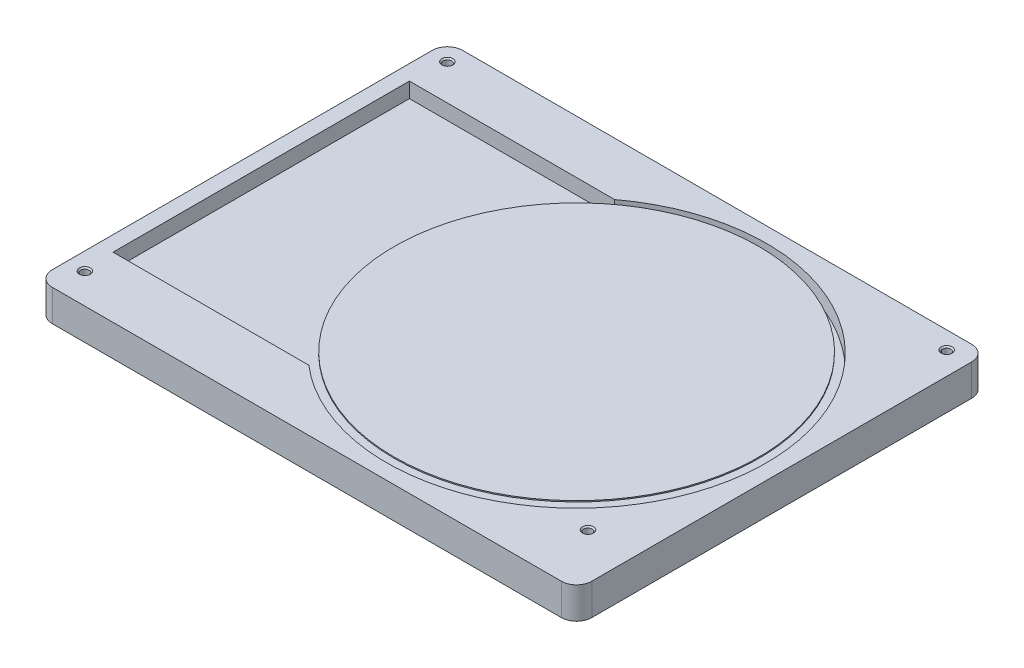
ISO-10303-21;
HEADER;
FILE_DESCRIPTION(('STEP AP214'),'2;1');
FILE_NAME('part.step','',(''),(''),'','','');
FILE_SCHEMA(('AUTOMOTIVE_DESIGN { 1 0 10303 214 1 1 1 1 }'));
ENDSEC;
DATA;
#1=APPLICATION_CONTEXT('core data for automotive mechanical design processes');
#2=APPLICATION_PROTOCOL_DEFINITION('international standard','automotive_design',2000,#1);
#3=PRODUCT_CONTEXT('',#1,'mechanical');
#4=PRODUCT('Part','Part','',(#3));
#5=PRODUCT_RELATED_PRODUCT_CATEGORY('part','',(#4));
#6=PRODUCT_DEFINITION_FORMATION('','',#4);
#7=PRODUCT_DEFINITION_CONTEXT('part definition',#1,'design');
#8=PRODUCT_DEFINITION('design','',#6,#7);
#9=PRODUCT_DEFINITION_SHAPE('','',#8);
#10=(LENGTH_UNIT() NAMED_UNIT(*) SI_UNIT(.MILLI.,.METRE.));
#11=(NAMED_UNIT(*) PLANE_ANGLE_UNIT() SI_UNIT($,.RADIAN.));
#12=(NAMED_UNIT(*) SI_UNIT($,.STERADIAN.) SOLID_ANGLE_UNIT());
#13=UNCERTAINTY_MEASURE_WITH_UNIT(LENGTH_MEASURE(1.E-05),#10,'distance_accuracy_value','');
#14=(GEOMETRIC_REPRESENTATION_CONTEXT(3) GLOBAL_UNCERTAINTY_ASSIGNED_CONTEXT((#13)) GLOBAL_UNIT_ASSIGNED_CONTEXT((#10,
#11,#12)) REPRESENTATION_CONTEXT('',''));
#15=CARTESIAN_POINT('',(0.,0.,0.));
#16=DIRECTION('',(0.,0.,1.));
#17=DIRECTION('',(1.,0.,0.));
#18=AXIS2_PLACEMENT_3D('',#15,#16,#17);
#19=CARTESIAN_POINT('',(35.5,4.15,27.));
#20=DIRECTION('',(-1.,0.,0.));
#21=DIRECTION('',(0.,0.,1.));
#22=AXIS2_PLACEMENT_3D('',#19,#20,#21);
#23=PLANE('',#22);
#24=DIRECTION('',(0.,0.,-1.));
#25=VECTOR('',#24,1.);
#26=CARTESIAN_POINT('',(35.5,0.,27.));
#27=LINE('',#26,#25);
#28=CARTESIAN_POINT('',(35.5,0.,25.));
#29=VERTEX_POINT('',#28);
#30=CARTESIAN_POINT('',(35.5,0.,-25.));
#31=VERTEX_POINT('',#30);
#32=EDGE_CURVE('E187',#29,#31,#27,.T.);
#33=ORIENTED_EDGE('',*,*,#32,.T.);
#34=DIRECTION('',(0.,-1.,0.));
#35=VECTOR('',#34,1.);
#36=CARTESIAN_POINT('',(35.5,4.15,-25.));
#37=LINE('',#36,#35);
#38=CARTESIAN_POINT('',(35.5,4.15,-25.));
#39=VERTEX_POINT('',#38);
#40=EDGE_CURVE('E11',#31,#39,#37,.F.);
#41=ORIENTED_EDGE('',*,*,#40,.T.);
#42=DIRECTION('',(0.,0.,-1.));
#43=VECTOR('',#42,1.);
#44=CARTESIAN_POINT('',(35.5,4.15,27.));
#45=LINE('',#44,#43);
#46=CARTESIAN_POINT('',(35.5,4.15,25.));
#47=VERTEX_POINT('',#46);
#48=EDGE_CURVE('E193',#47,#39,#45,.T.);
#49=ORIENTED_EDGE('',*,*,#48,.F.);
#50=DIRECTION('',(0.,-1.,0.));
#51=VECTOR('',#50,1.);
#52=CARTESIAN_POINT('',(35.5,4.15,25.));
#53=LINE('',#52,#51);
#54=EDGE_CURVE('E52',#47,#29,#53,.T.);
#55=ORIENTED_EDGE('',*,*,#54,.T.);
#56=EDGE_LOOP('',(#33,#41,#49,#55));
#57=FACE_BOUND('',#56,.T.);
#58=ADVANCED_FACE('F43',(#57),#23,.F.);
#59=CARTESIAN_POINT('',(-35.5,4.15,-27.));
#60=DIRECTION('',(0.,0.,1.));
#61=DIRECTION('',(1.,0.,0.));
#62=AXIS2_PLACEMENT_3D('',#59,#60,#61);
#63=PLANE('',#62);
#64=DIRECTION('',(-1.,0.,0.));
#65=VECTOR('',#64,1.);
#66=CARTESIAN_POINT('',(-35.5,0.,-27.));
#67=LINE('',#66,#65);
#68=CARTESIAN_POINT('',(33.5,0.,-27.));
#69=VERTEX_POINT('',#68);
#70=CARTESIAN_POINT('',(-33.5,0.,-27.));
#71=VERTEX_POINT('',#70);
#72=EDGE_CURVE('E212',#69,#71,#67,.T.);
#73=ORIENTED_EDGE('',*,*,#72,.T.);
#74=DIRECTION('',(0.,-1.,0.));
#75=VECTOR('',#74,1.);
#76=CARTESIAN_POINT('',(-33.5,4.15,-27.));
#77=LINE('',#76,#75);
#78=CARTESIAN_POINT('',(-33.5,4.15,-27.));
#79=VERTEX_POINT('',#78);
#80=EDGE_CURVE('E59',#71,#79,#77,.F.);
#81=ORIENTED_EDGE('',*,*,#80,.T.);
#82=DIRECTION('',(-1.,0.,0.));
#83=VECTOR('',#82,1.);
#84=CARTESIAN_POINT('',(-35.5,4.15,-27.));
#85=LINE('',#84,#83);
#86=CARTESIAN_POINT('',(33.5,4.15,-27.));
#87=VERTEX_POINT('',#86);
#88=EDGE_CURVE('E196',#87,#79,#85,.T.);
#89=ORIENTED_EDGE('',*,*,#88,.F.);
#90=DIRECTION('',(0.,-1.,0.));
#91=VECTOR('',#90,1.);
#92=CARTESIAN_POINT('',(33.5,4.15,-27.));
#93=LINE('',#92,#91);
#94=EDGE_CURVE('E258',#87,#69,#93,.T.);
#95=ORIENTED_EDGE('',*,*,#94,.T.);
#96=EDGE_LOOP('',(#73,#81,#89,#95));
#97=FACE_BOUND('',#96,.T.);
#98=ADVANCED_FACE('F279',(#97),#63,.F.);
#99=CARTESIAN_POINT('',(-35.5,4.15,27.));
#100=DIRECTION('',(1.,0.,0.));
#101=DIRECTION('',(0.,0.,-1.));
#102=AXIS2_PLACEMENT_3D('',#99,#100,#101);
#103=PLANE('',#102);
#104=DIRECTION('',(0.,0.,1.));
#105=VECTOR('',#104,1.);
#106=CARTESIAN_POINT('',(-35.5,0.,27.));
#107=LINE('',#106,#105);
#108=CARTESIAN_POINT('',(-35.5,0.,-25.));
#109=VERTEX_POINT('',#108);
#110=CARTESIAN_POINT('',(-35.5,0.,25.));
#111=VERTEX_POINT('',#110);
#112=EDGE_CURVE('E215',#109,#111,#107,.T.);
#113=ORIENTED_EDGE('',*,*,#112,.T.);
#114=DIRECTION('',(0.,-1.,0.));
#115=VECTOR('',#114,1.);
#116=CARTESIAN_POINT('',(-35.5,4.15,25.));
#117=LINE('',#116,#115);
#118=CARTESIAN_POINT('',(-35.5,4.15,25.));
#119=VERTEX_POINT('',#118);
#120=EDGE_CURVE('E244',#111,#119,#117,.F.);
#121=ORIENTED_EDGE('',*,*,#120,.T.);
#122=DIRECTION('',(0.,0.,1.));
#123=VECTOR('',#122,1.);
#124=CARTESIAN_POINT('',(-35.5,4.15,27.));
#125=LINE('',#124,#123);
#126=CARTESIAN_POINT('',(-35.5,4.15,-25.));
#127=VERTEX_POINT('',#126);
#128=EDGE_CURVE('E200',#127,#119,#125,.T.);
#129=ORIENTED_EDGE('',*,*,#128,.F.);
#130=DIRECTION('',(0.,-1.,0.));
#131=VECTOR('',#130,1.);
#132=CARTESIAN_POINT('',(-35.5,4.15,-25.));
#133=LINE('',#132,#131);
#134=EDGE_CURVE('E240',#127,#109,#133,.T.);
#135=ORIENTED_EDGE('',*,*,#134,.T.);
#136=EDGE_LOOP('',(#113,#121,#129,#135));
#137=FACE_BOUND('',#136,.T.);
#138=ADVANCED_FACE('F288',(#137),#103,.F.);
#139=CARTESIAN_POINT('',(-35.5,4.15,27.));
#140=DIRECTION('',(0.,0.,-1.));
#141=DIRECTION('',(-1.,0.,0.));
#142=AXIS2_PLACEMENT_3D('',#139,#140,#141);
#143=PLANE('',#142);
#144=DIRECTION('',(1.,0.,0.));
#145=VECTOR('',#144,1.);
#146=CARTESIAN_POINT('',(-35.5,4.15,27.));
#147=LINE('',#146,#145);
#148=CARTESIAN_POINT('',(-33.5,4.15,27.));
#149=VERTEX_POINT('',#148);
#150=CARTESIAN_POINT('',(33.5,4.15,27.));
#151=VERTEX_POINT('',#150);
#152=EDGE_CURVE('E204',#149,#151,#147,.T.);
#153=ORIENTED_EDGE('',*,*,#152,.F.);
#154=DIRECTION('',(0.,-1.,0.));
#155=VECTOR('',#154,1.);
#156=CARTESIAN_POINT('',(-33.5,4.15,27.));
#157=LINE('',#156,#155);
#158=CARTESIAN_POINT('',(-33.5,0.,27.));
#159=VERTEX_POINT('',#158);
#160=EDGE_CURVE('E224',#149,#159,#157,.T.);
#161=ORIENTED_EDGE('',*,*,#160,.T.);
#162=DIRECTION('',(1.,0.,0.));
#163=VECTOR('',#162,1.);
#164=CARTESIAN_POINT('',(-35.5,0.,27.));
#165=LINE('',#164,#163);
#166=CARTESIAN_POINT('',(33.5,0.,27.));
#167=VERTEX_POINT('',#166);
#168=EDGE_CURVE('E197',#159,#167,#165,.T.);
#169=ORIENTED_EDGE('',*,*,#168,.T.);
#170=DIRECTION('',(0.,-1.,0.));
#171=VECTOR('',#170,1.);
#172=CARTESIAN_POINT('',(33.5,4.15,27.));
#173=LINE('',#172,#171);
#174=EDGE_CURVE('E208',#167,#151,#173,.F.);
#175=ORIENTED_EDGE('',*,*,#174,.T.);
#176=EDGE_LOOP('',(#153,#161,#169,#175));
#177=FACE_BOUND('',#176,.T.);
#178=ADVANCED_FACE('F296',(#177),#143,.F.);
#179=CARTESIAN_POINT('',(0.,4.15,0.));
#180=DIRECTION('',(0.,-1.,0.));
#181=DIRECTION('',(0.,0.,-1.));
#182=AXIS2_PLACEMENT_3D('',#179,#180,#181);
#183=PLANE('',#182);
#184=CARTESIAN_POINT('',(-33.2,4.15,-24.7));
#185=DIRECTION('',(0.,1.,0.));
#186=DIRECTION('',(0.,0.,1.));
#187=AXIS2_PLACEMENT_3D('',#184,#185,#186);
#188=CIRCLE('',#187,0.724999999999997);
#189=CARTESIAN_POINT('',(-33.2,4.15,-23.975));
#190=VERTEX_POINT('',#189);
#191=EDGE_CURVE('E578',#190,#190,#188,.T.);
#192=ORIENTED_EDGE('',*,*,#191,.F.);
#193=EDGE_LOOP('',(#192));
#194=FACE_BOUND('',#193,.T.);
#195=CARTESIAN_POINT('',(-33.2,4.15,23.));
#196=DIRECTION('',(0.,1.,0.));
#197=DIRECTION('',(0.,0.,1.));
#198=AXIS2_PLACEMENT_3D('',#195,#196,#197);
#199=CIRCLE('',#198,0.725000000000003);
#200=CARTESIAN_POINT('',(-33.2,4.15,23.725));
#201=VERTEX_POINT('',#200);
#202=EDGE_CURVE('E582',#201,#201,#199,.T.);
#203=ORIENTED_EDGE('',*,*,#202,.F.);
#204=EDGE_LOOP('',(#203));
#205=FACE_BOUND('',#204,.T.);
#206=CARTESIAN_POINT('',(29.4,4.15,19.4));
#207=DIRECTION('',(0.,1.,0.));
#208=DIRECTION('',(0.,0.,1.));
#209=AXIS2_PLACEMENT_3D('',#206,#207,#208);
#210=CIRCLE('',#209,0.725);
#211=CARTESIAN_POINT('',(29.4,4.15,20.125));
#212=VERTEX_POINT('',#211);
#213=EDGE_CURVE('E586',#212,#212,#210,.T.);
#214=ORIENTED_EDGE('',*,*,#213,.F.);
#215=EDGE_LOOP('',(#214));
#216=FACE_BOUND('',#215,.T.);
#217=CARTESIAN_POINT('',(32.5,4.15,-24.7));
#218=DIRECTION('',(0.,1.,0.));
#219=DIRECTION('',(0.,0.,1.));
#220=AXIS2_PLACEMENT_3D('',#217,#218,#219);
#221=CIRCLE('',#220,0.724999999999997);
#222=CARTESIAN_POINT('',(32.5,4.15,-23.975));
#223=VERTEX_POINT('',#222);
#224=EDGE_CURVE('E590',#223,#223,#221,.T.);
#225=ORIENTED_EDGE('',*,*,#224,.F.);
#226=EDGE_LOOP('',(#225));
#227=FACE_BOUND('',#226,.T.);
#228=DIRECTION('',(-1.,0.,0.));
#229=VECTOR('',#228,1.);
#230=CARTESIAN_POINT('',(-6.50000000000003,4.15,-20.));
#231=LINE('',#230,#229);
#232=CARTESIAN_POINT('',(-6.50000000000003,4.15,-20.));
#233=VERTEX_POINT('',#232);
#234=CARTESIAN_POINT('',(-33.5,4.15,-20.));
#235=VERTEX_POINT('',#234);
#236=EDGE_CURVE('E177',#233,#235,#231,.T.);
#237=ORIENTED_EDGE('',*,*,#236,.F.);
#238=CARTESIAN_POINT('',(8.49999999999999,4.15,0.));
#239=DIRECTION('',(0.,1.,0.));
#240=DIRECTION('',(0.,0.,1.));
#241=AXIS2_PLACEMENT_3D('',#238,#239,#240);
#242=CIRCLE('',#241,25.);
#243=CARTESIAN_POINT('',(-7.74807680927193,4.15,19.));
#244=VERTEX_POINT('',#243);
#245=EDGE_CURVE('E141',#244,#233,#242,.T.);
#246=ORIENTED_EDGE('',*,*,#245,.F.);
#247=DIRECTION('',(1.,0.,0.));
#248=VECTOR('',#247,1.);
#249=CARTESIAN_POINT('',(-7.74807680927193,4.15,19.));
#250=LINE('',#249,#248);
#251=CARTESIAN_POINT('',(-33.5,4.15,19.));
#252=VERTEX_POINT('',#251);
#253=EDGE_CURVE('E161',#252,#244,#250,.T.);
#254=ORIENTED_EDGE('',*,*,#253,.F.);
#255=DIRECTION('',(0.,0.,1.));
#256=VECTOR('',#255,1.);
#257=CARTESIAN_POINT('',(-33.5,4.15,-20.));
#258=LINE('',#257,#256);
#259=EDGE_CURVE('E165',#235,#252,#258,.T.);
#260=ORIENTED_EDGE('',*,*,#259,.F.);
#261=EDGE_LOOP('',(#237,#246,#254,#260));
#262=FACE_BOUND('',#261,.T.);
#263=ORIENTED_EDGE('',*,*,#128,.T.);
#264=CARTESIAN_POINT('',(-33.5,4.15,25.));
#265=DIRECTION('',(0.,-1.,0.));
#266=DIRECTION('',(0.,0.,-1.));
#267=AXIS2_PLACEMENT_3D('',#264,#265,#266);
#268=CIRCLE('',#267,2.);
#269=EDGE_CURVE('E255',#119,#149,#268,.F.);
#270=ORIENTED_EDGE('',*,*,#269,.T.);
#271=ORIENTED_EDGE('',*,*,#152,.T.);
#272=CARTESIAN_POINT('',(33.5,4.15,25.));
#273=DIRECTION('',(0.,-1.,0.));
#274=DIRECTION('',(0.,0.,-1.));
#275=AXIS2_PLACEMENT_3D('',#272,#273,#274);
#276=CIRCLE('',#275,2.);
#277=EDGE_CURVE('E247',#151,#47,#276,.F.);
#278=ORIENTED_EDGE('',*,*,#277,.T.);
#279=ORIENTED_EDGE('',*,*,#48,.T.);
#280=CARTESIAN_POINT('',(33.5,4.15,-25.));
#281=DIRECTION('',(0.,-1.,0.));
#282=DIRECTION('',(0.,0.,-1.));
#283=AXIS2_PLACEMENT_3D('',#280,#281,#282);
#284=CIRCLE('',#283,2.);
#285=EDGE_CURVE('E66',#39,#87,#284,.F.);
#286=ORIENTED_EDGE('',*,*,#285,.T.);
#287=ORIENTED_EDGE('',*,*,#88,.T.);
#288=CARTESIAN_POINT('',(-33.5,4.15,-25.));
#289=DIRECTION('',(0.,-1.,0.));
#290=DIRECTION('',(0.,0.,-1.));
#291=AXIS2_PLACEMENT_3D('',#288,#289,#290);
#292=CIRCLE('',#291,2.);
#293=EDGE_CURVE('E252',#79,#127,#292,.F.);
#294=ORIENTED_EDGE('',*,*,#293,.T.);
#295=EDGE_LOOP('',(#263,#270,#271,#278,#279,#286,#287,#294));
#296=FACE_BOUND('',#295,.T.);
#297=ADVANCED_FACE('F281',(#194,#205,#216,#227,#262,#296),#183,.F.);
#298=CARTESIAN_POINT('',(0.,0.,0.));
#299=DIRECTION('',(0.,-1.,0.));
#300=DIRECTION('',(0.,0.,-1.));
#301=AXIS2_PLACEMENT_3D('',#298,#299,#300);
#302=PLANE('',#301);
#303=CARTESIAN_POINT('',(-33.2,0.,-24.7));
#304=DIRECTION('',(0.,1.,0.));
#305=DIRECTION('',(0.,0.,1.));
#306=AXIS2_PLACEMENT_3D('',#303,#304,#305);
#307=CIRCLE('',#306,0.550000000000002);
#308=CARTESIAN_POINT('',(-33.2,0.,-24.15));
#309=VERTEX_POINT('',#308);
#310=EDGE_CURVE('E648',#309,#309,#307,.T.);
#311=ORIENTED_EDGE('',*,*,#310,.T.);
#312=EDGE_LOOP('',(#311));
#313=FACE_BOUND('',#312,.T.);
#314=CARTESIAN_POINT('',(-33.2,0.,23.));
#315=DIRECTION('',(0.,1.,0.));
#316=DIRECTION('',(0.,0.,1.));
#317=AXIS2_PLACEMENT_3D('',#314,#315,#316);
#318=CIRCLE('',#317,0.550000000000002);
#319=CARTESIAN_POINT('',(-33.2,0.,23.55));
#320=VERTEX_POINT('',#319);
#321=EDGE_CURVE('E638',#320,#320,#318,.T.);
#322=ORIENTED_EDGE('',*,*,#321,.T.);
#323=EDGE_LOOP('',(#322));
#324=FACE_BOUND('',#323,.T.);
#325=CARTESIAN_POINT('',(29.4,0.,19.4));
#326=DIRECTION('',(0.,1.,0.));
#327=DIRECTION('',(0.,0.,1.));
#328=AXIS2_PLACEMENT_3D('',#325,#326,#327);
#329=CIRCLE('',#328,0.549999999999998);
#330=CARTESIAN_POINT('',(29.4,0.,19.95));
#331=VERTEX_POINT('',#330);
#332=EDGE_CURVE('E596',#331,#331,#329,.T.);
#333=ORIENTED_EDGE('',*,*,#332,.T.);
#334=EDGE_LOOP('',(#333));
#335=FACE_BOUND('',#334,.T.);
#336=CARTESIAN_POINT('',(32.5,0.,-24.7));
#337=DIRECTION('',(0.,1.,0.));
#338=DIRECTION('',(0.,0.,1.));
#339=AXIS2_PLACEMENT_3D('',#336,#337,#338);
#340=CIRCLE('',#339,0.550000000000002);
#341=CARTESIAN_POINT('',(32.5,0.,-24.15));
#342=VERTEX_POINT('',#341);
#343=EDGE_CURVE('E601',#342,#342,#340,.T.);
#344=ORIENTED_EDGE('',*,*,#343,.T.);
#345=EDGE_LOOP('',(#344));
#346=FACE_BOUND('',#345,.T.);
#347=ORIENTED_EDGE('',*,*,#168,.F.);
#348=CARTESIAN_POINT('',(-33.5,0.,25.));
#349=DIRECTION('',(0.,-1.,0.));
#350=DIRECTION('',(0.,0.,-1.));
#351=AXIS2_PLACEMENT_3D('',#348,#349,#350);
#352=CIRCLE('',#351,2.);
#353=EDGE_CURVE('E237',#159,#111,#352,.T.);
#354=ORIENTED_EDGE('',*,*,#353,.T.);
#355=ORIENTED_EDGE('',*,*,#112,.F.);
#356=CARTESIAN_POINT('',(-33.5,0.,-25.));
#357=DIRECTION('',(0.,-1.,0.));
#358=DIRECTION('',(0.,0.,-1.));
#359=AXIS2_PLACEMENT_3D('',#356,#357,#358);
#360=CIRCLE('',#359,2.);
#361=EDGE_CURVE('E234',#109,#71,#360,.T.);
#362=ORIENTED_EDGE('',*,*,#361,.T.);
#363=ORIENTED_EDGE('',*,*,#72,.F.);
#364=CARTESIAN_POINT('',(33.5,0.,-25.));
#365=DIRECTION('',(0.,-1.,0.));
#366=DIRECTION('',(0.,0.,-1.));
#367=AXIS2_PLACEMENT_3D('',#364,#365,#366);
#368=CIRCLE('',#367,2.);
#369=EDGE_CURVE('E231',#69,#31,#368,.T.);
#370=ORIENTED_EDGE('',*,*,#369,.T.);
#371=ORIENTED_EDGE('',*,*,#32,.F.);
#372=CARTESIAN_POINT('',(33.5,0.,25.));
#373=DIRECTION('',(0.,-1.,0.));
#374=DIRECTION('',(0.,0.,-1.));
#375=AXIS2_PLACEMENT_3D('',#372,#373,#374);
#376=CIRCLE('',#375,2.);
#377=EDGE_CURVE('E228',#29,#167,#376,.T.);
#378=ORIENTED_EDGE('',*,*,#377,.T.);
#379=EDGE_LOOP('',(#347,#354,#355,#362,#363,#370,#371,#378));
#380=FACE_BOUND('',#379,.T.);
#381=ADVANCED_FACE('F274',(#313,#324,#335,#346,#380),#302,.T.);
#382=CARTESIAN_POINT('',(8.49999999999999,2.15,0.));
#383=DIRECTION('',(0.,1.,0.));
#384=DIRECTION('',(0.,0.,1.));
#385=AXIS2_PLACEMENT_3D('',#382,#383,#384);
#386=CYLINDRICAL_SURFACE('',#385,25.);
#387=ORIENTED_EDGE('',*,*,#245,.T.);
#388=DIRECTION('',(0.,1.,0.));
#389=VECTOR('',#388,1.);
#390=CARTESIAN_POINT('',(-6.50000000000003,2.15,-20.));
#391=LINE('',#390,#389);
#392=CARTESIAN_POINT('',(-6.50000000000003,2.15,-20.));
#393=VERTEX_POINT('',#392);
#394=EDGE_CURVE('E134',#393,#233,#391,.T.);
#395=ORIENTED_EDGE('',*,*,#394,.F.);
#396=CARTESIAN_POINT('',(8.49999999999999,2.15,0.));
#397=DIRECTION('',(0.,1.,0.));
#398=DIRECTION('',(0.,0.,1.));
#399=AXIS2_PLACEMENT_3D('',#396,#397,#398);
#400=CIRCLE('',#399,25.);
#401=CARTESIAN_POINT('',(-7.74807680927193,2.15,19.));
#402=VERTEX_POINT('',#401);
#403=EDGE_CURVE('E138',#402,#393,#400,.T.);
#404=ORIENTED_EDGE('',*,*,#403,.F.);
#405=DIRECTION('',(0.,1.,0.));
#406=VECTOR('',#405,1.);
#407=CARTESIAN_POINT('',(-7.74807680927193,2.15,19.));
#408=LINE('',#407,#406);
#409=EDGE_CURVE('E184',#402,#244,#408,.T.);
#410=ORIENTED_EDGE('',*,*,#409,.T.);
#411=EDGE_LOOP('',(#387,#395,#404,#410));
#412=FACE_BOUND('',#411,.T.);
#413=ADVANCED_FACE('F136',(#412),#386,.F.);
#414=CARTESIAN_POINT('',(-7.74807680927193,2.15,19.));
#415=DIRECTION('',(0.,0.,1.));
#416=DIRECTION('',(1.,0.,0.));
#417=AXIS2_PLACEMENT_3D('',#414,#415,#416);
#418=PLANE('',#417);
#419=ORIENTED_EDGE('',*,*,#253,.T.);
#420=ORIENTED_EDGE('',*,*,#409,.F.);
#421=DIRECTION('',(1.,0.,0.));
#422=VECTOR('',#421,1.);
#423=CARTESIAN_POINT('',(-7.74807680927193,2.15,19.));
#424=LINE('',#423,#422);
#425=CARTESIAN_POINT('',(-33.5,2.15,19.));
#426=VERTEX_POINT('',#425);
#427=EDGE_CURVE('E147',#426,#402,#424,.T.);
#428=ORIENTED_EDGE('',*,*,#427,.F.);
#429=DIRECTION('',(0.,1.,0.));
#430=VECTOR('',#429,1.);
#431=CARTESIAN_POINT('',(-33.5,2.15,19.));
#432=LINE('',#431,#430);
#433=EDGE_CURVE('E188',#426,#252,#432,.T.);
#434=ORIENTED_EDGE('',*,*,#433,.T.);
#435=EDGE_LOOP('',(#419,#420,#428,#434));
#436=FACE_BOUND('',#435,.T.);
#437=ADVANCED_FACE('F474',(#436),#418,.F.);
#438=CARTESIAN_POINT('',(-33.5,2.15,-20.));
#439=DIRECTION('',(-1.,0.,0.));
#440=DIRECTION('',(0.,0.,1.));
#441=AXIS2_PLACEMENT_3D('',#438,#439,#440);
#442=PLANE('',#441);
#443=ORIENTED_EDGE('',*,*,#259,.T.);
#444=ORIENTED_EDGE('',*,*,#433,.F.);
#445=DIRECTION('',(0.,0.,1.));
#446=VECTOR('',#445,1.);
#447=CARTESIAN_POINT('',(-33.5,2.15,-20.));
#448=LINE('',#447,#446);
#449=CARTESIAN_POINT('',(-33.5,2.15,-20.));
#450=VERTEX_POINT('',#449);
#451=EDGE_CURVE('E156',#450,#426,#448,.T.);
#452=ORIENTED_EDGE('',*,*,#451,.F.);
#453=DIRECTION('',(0.,1.,0.));
#454=VECTOR('',#453,1.);
#455=CARTESIAN_POINT('',(-33.5,2.15,-20.));
#456=LINE('',#455,#454);
#457=EDGE_CURVE('E146',#450,#235,#456,.T.);
#458=ORIENTED_EDGE('',*,*,#457,.T.);
#459=EDGE_LOOP('',(#443,#444,#452,#458));
#460=FACE_BOUND('',#459,.T.);
#461=ADVANCED_FACE('F466',(#460),#442,.F.);
#462=CARTESIAN_POINT('',(-6.50000000000003,2.15,-20.));
#463=DIRECTION('',(0.,0.,-1.));
#464=DIRECTION('',(-1.,0.,0.));
#465=AXIS2_PLACEMENT_3D('',#462,#463,#464);
#466=PLANE('',#465);
#467=ORIENTED_EDGE('',*,*,#236,.T.);
#468=ORIENTED_EDGE('',*,*,#457,.F.);
#469=DIRECTION('',(-1.,0.,0.));
#470=VECTOR('',#469,1.);
#471=CARTESIAN_POINT('',(-6.50000000000003,2.15,-20.));
#472=LINE('',#471,#470);
#473=EDGE_CURVE('E150',#393,#450,#472,.T.);
#474=ORIENTED_EDGE('',*,*,#473,.F.);
#475=ORIENTED_EDGE('',*,*,#394,.T.);
#476=EDGE_LOOP('',(#467,#468,#474,#475));
#477=FACE_BOUND('',#476,.T.);
#478=ADVANCED_FACE('F151',(#477),#466,.F.);
#479=CARTESIAN_POINT('',(8.49999999999999,2.15,0.));
#480=DIRECTION('',(0.,1.,0.));
#481=DIRECTION('',(0.,0.,1.));
#482=AXIS2_PLACEMENT_3D('',#479,#480,#481);
#483=PLANE('',#482);
#484=CARTESIAN_POINT('',(8.49999999999999,2.15,0.));
#485=DIRECTION('',(0.,1.,0.));
#486=DIRECTION('',(0.,0.,1.));
#487=AXIS2_PLACEMENT_3D('',#484,#485,#486);
#488=CIRCLE('',#487,7.5);
#489=CARTESIAN_POINT('',(8.49999999999999,2.15,7.5));
#490=VERTEX_POINT('',#489);
#491=EDGE_CURVE('E168',#490,#490,#488,.T.);
#492=ORIENTED_EDGE('',*,*,#491,.F.);
#493=EDGE_LOOP('',(#492));
#494=FACE_BOUND('',#493,.T.);
#495=ORIENTED_EDGE('',*,*,#403,.T.);
#496=ORIENTED_EDGE('',*,*,#473,.T.);
#497=ORIENTED_EDGE('',*,*,#451,.T.);
#498=ORIENTED_EDGE('',*,*,#427,.T.);
#499=EDGE_LOOP('',(#495,#496,#497,#498));
#500=FACE_BOUND('',#499,.T.);
#501=ADVANCED_FACE('F158',(#494,#500),#483,.T.);
#502=CARTESIAN_POINT('',(8.49999999999999,4.15,0.));
#503=DIRECTION('',(0.,-1.,0.));
#504=DIRECTION('',(0.,0.,-1.));
#505=AXIS2_PLACEMENT_3D('',#502,#503,#504);
#506=CYLINDRICAL_SURFACE('',#505,7.5);
#507=CARTESIAN_POINT('',(8.49999999999999,4.15,0.));
#508=DIRECTION('',(0.,1.,0.));
#509=DIRECTION('',(0.,0.,1.));
#510=AXIS2_PLACEMENT_3D('',#507,#508,#509);
#511=CIRCLE('',#510,7.5);
#512=CARTESIAN_POINT('',(8.49999999999999,4.15,7.5));
#513=VERTEX_POINT('',#512);
#514=EDGE_CURVE('E178',#513,#513,#511,.T.);
#515=ORIENTED_EDGE('',*,*,#514,.F.);
#516=EDGE_LOOP('',(#515));
#517=FACE_BOUND('',#516,.T.);
#518=ORIENTED_EDGE('',*,*,#491,.T.);
#519=EDGE_LOOP('',(#518));
#520=FACE_BOUND('',#519,.T.);
#521=ADVANCED_FACE('F441',(#517,#520),#506,.T.);
#522=CARTESIAN_POINT('',(8.49999999999999,4.3,0.));
#523=DIRECTION('',(0.,-1.,0.));
#524=DIRECTION('',(0.,0.,-1.));
#525=AXIS2_PLACEMENT_3D('',#522,#523,#524);
#526=CYLINDRICAL_SURFACE('',#525,24.);
#527=CARTESIAN_POINT('',(8.49999999999999,4.3,0.));
#528=DIRECTION('',(0.,1.,0.));
#529=DIRECTION('',(0.,0.,1.));
#530=AXIS2_PLACEMENT_3D('',#527,#528,#529);
#531=CIRCLE('',#530,24.);
#532=CARTESIAN_POINT('',(8.49999999999999,4.3,24.));
#533=VERTEX_POINT('',#532);
#534=EDGE_CURVE('E612',#533,#533,#531,.T.);
#535=ORIENTED_EDGE('',*,*,#534,.F.);
#536=EDGE_LOOP('',(#535));
#537=FACE_BOUND('',#536,.T.);
#538=CARTESIAN_POINT('',(8.49999999999999,4.15,0.));
#539=DIRECTION('',(0.,1.,0.));
#540=DIRECTION('',(0.,0.,1.));
#541=AXIS2_PLACEMENT_3D('',#538,#539,#540);
#542=CIRCLE('',#541,24.);
#543=CARTESIAN_POINT('',(8.49999999999999,4.15,24.));
#544=VERTEX_POINT('',#543);
#545=EDGE_CURVE('E611',#544,#544,#542,.T.);
#546=ORIENTED_EDGE('',*,*,#545,.T.);
#547=EDGE_LOOP('',(#546));
#548=FACE_BOUND('',#547,.T.);
#549=ADVANCED_FACE('F432',(#537,#548),#526,.T.);
#550=CARTESIAN_POINT('',(8.49999999999999,4.3,0.));
#551=DIRECTION('',(0.,1.,0.));
#552=DIRECTION('',(0.,0.,1.));
#553=AXIS2_PLACEMENT_3D('',#550,#551,#552);
#554=PLANE('',#553);
#555=ORIENTED_EDGE('',*,*,#534,.T.);
#556=EDGE_LOOP('',(#555));
#557=FACE_BOUND('',#556,.T.);
#558=ADVANCED_FACE('F423',(#557),#554,.T.);
#559=CARTESIAN_POINT('',(8.49999999999999,4.15,0.));
#560=DIRECTION('',(0.,1.,0.));
#561=DIRECTION('',(0.,0.,1.));
#562=AXIS2_PLACEMENT_3D('',#559,#560,#561);
#563=PLANE('',#562);
#564=ORIENTED_EDGE('',*,*,#514,.T.);
#565=EDGE_LOOP('',(#564));
#566=FACE_BOUND('',#565,.T.);
#567=ORIENTED_EDGE('',*,*,#545,.F.);
#568=EDGE_LOOP('',(#567));
#569=FACE_BOUND('',#568,.T.);
#570=ADVANCED_FACE('F413',(#566,#569),#563,.F.);
#571=CARTESIAN_POINT('',(32.5,4.15,-24.7));
#572=DIRECTION('',(0.,1.,0.));
#573=DIRECTION('',(0.,0.,1.));
#574=AXIS2_PLACEMENT_3D('',#571,#572,#573);
#575=CYLINDRICAL_SURFACE('',#574,0.550000000000002);
#576=ORIENTED_EDGE('',*,*,#343,.F.);
#577=EDGE_LOOP('',(#576));
#578=FACE_BOUND('',#577,.T.);
#579=CARTESIAN_POINT('',(32.5,3.975,-24.7));
#580=DIRECTION('',(0.,1.,0.));
#581=DIRECTION('',(0.,0.,1.));
#582=AXIS2_PLACEMENT_3D('',#579,#580,#581);
#583=CIRCLE('',#582,0.550000000000002);
#584=CARTESIAN_POINT('',(32.5,3.975,-24.15));
#585=VERTEX_POINT('',#584);
#586=EDGE_CURVE('E595',#585,#585,#583,.T.);
#587=ORIENTED_EDGE('',*,*,#586,.T.);
#588=EDGE_LOOP('',(#587));
#589=FACE_BOUND('',#588,.T.);
#590=ADVANCED_FACE('F403',(#578,#589),#575,.F.);
#591=CARTESIAN_POINT('',(32.5,4.15,-24.7));
#592=DIRECTION('',(0.,1.,0.));
#593=DIRECTION('',(0.,0.,1.));
#594=AXIS2_PLACEMENT_3D('',#591,#592,#593);
#595=CONICAL_SURFACE('',#594,0.724999999999997,0.785398163397429);
#596=ORIENTED_EDGE('',*,*,#586,.F.);
#597=EDGE_LOOP('',(#596));
#598=FACE_BOUND('',#597,.T.);
#599=ORIENTED_EDGE('',*,*,#224,.T.);
#600=EDGE_LOOP('',(#599));
#601=FACE_BOUND('',#600,.T.);
#602=ADVANCED_FACE('F393',(#598,#601),#595,.F.);
#603=CARTESIAN_POINT('',(29.4,4.15,19.4));
#604=DIRECTION('',(0.,1.,0.));
#605=DIRECTION('',(0.,0.,1.));
#606=AXIS2_PLACEMENT_3D('',#603,#604,#605);
#607=CYLINDRICAL_SURFACE('',#606,0.549999999999998);
#608=ORIENTED_EDGE('',*,*,#332,.F.);
#609=EDGE_LOOP('',(#608));
#610=FACE_BOUND('',#609,.T.);
#611=CARTESIAN_POINT('',(29.4,3.975,19.4));
#612=DIRECTION('',(0.,1.,0.));
#613=DIRECTION('',(0.,0.,1.));
#614=AXIS2_PLACEMENT_3D('',#611,#612,#613);
#615=CIRCLE('',#614,0.549999999999998);
#616=CARTESIAN_POINT('',(29.4,3.975,19.95));
#617=VERTEX_POINT('',#616);
#618=EDGE_CURVE('E604',#617,#617,#615,.T.);
#619=ORIENTED_EDGE('',*,*,#618,.T.);
#620=EDGE_LOOP('',(#619));
#621=FACE_BOUND('',#620,.T.);
#622=ADVANCED_FACE('F383',(#610,#621),#607,.F.);
#623=CARTESIAN_POINT('',(29.4,4.15,19.4));
#624=DIRECTION('',(0.,1.,0.));
#625=DIRECTION('',(0.,0.,1.));
#626=AXIS2_PLACEMENT_3D('',#623,#624,#625);
#627=CONICAL_SURFACE('',#626,0.725,0.785398163397448);
#628=ORIENTED_EDGE('',*,*,#618,.F.);
#629=EDGE_LOOP('',(#628));
#630=FACE_BOUND('',#629,.T.);
#631=ORIENTED_EDGE('',*,*,#213,.T.);
#632=EDGE_LOOP('',(#631));
#633=FACE_BOUND('',#632,.T.);
#634=ADVANCED_FACE('F373',(#630,#633),#627,.F.);
#635=CARTESIAN_POINT('',(-33.2,4.15,23.));
#636=DIRECTION('',(0.,1.,0.));
#637=DIRECTION('',(0.,0.,1.));
#638=AXIS2_PLACEMENT_3D('',#635,#636,#637);
#639=CYLINDRICAL_SURFACE('',#638,0.550000000000002);
#640=ORIENTED_EDGE('',*,*,#321,.F.);
#641=EDGE_LOOP('',(#640));
#642=FACE_BOUND('',#641,.T.);
#643=CARTESIAN_POINT('',(-33.2,3.975,23.));
#644=DIRECTION('',(0.,1.,0.));
#645=DIRECTION('',(0.,0.,1.));
#646=AXIS2_PLACEMENT_3D('',#643,#644,#645);
#647=CIRCLE('',#646,0.550000000000002);
#648=CARTESIAN_POINT('',(-33.2,3.975,23.55));
#649=VERTEX_POINT('',#648);
#650=EDGE_CURVE('E642',#649,#649,#647,.T.);
#651=ORIENTED_EDGE('',*,*,#650,.T.);
#652=EDGE_LOOP('',(#651));
#653=FACE_BOUND('',#652,.T.);
#654=ADVANCED_FACE('F363',(#642,#653),#639,.F.);
#655=CARTESIAN_POINT('',(-33.2,4.15,23.));
#656=DIRECTION('',(0.,1.,0.));
#657=DIRECTION('',(0.,0.,1.));
#658=AXIS2_PLACEMENT_3D('',#655,#656,#657);
#659=CONICAL_SURFACE('',#658,0.725000000000003,0.785398163397448);
#660=ORIENTED_EDGE('',*,*,#650,.F.);
#661=EDGE_LOOP('',(#660));
#662=FACE_BOUND('',#661,.T.);
#663=ORIENTED_EDGE('',*,*,#202,.T.);
#664=EDGE_LOOP('',(#663));
#665=FACE_BOUND('',#664,.T.);
#666=ADVANCED_FACE('F353',(#662,#665),#659,.F.);
#667=CARTESIAN_POINT('',(-33.2,4.15,-24.7));
#668=DIRECTION('',(0.,1.,0.));
#669=DIRECTION('',(0.,0.,1.));
#670=AXIS2_PLACEMENT_3D('',#667,#668,#669);
#671=CYLINDRICAL_SURFACE('',#670,0.550000000000002);
#672=ORIENTED_EDGE('',*,*,#310,.F.);
#673=EDGE_LOOP('',(#672));
#674=FACE_BOUND('',#673,.T.);
#675=CARTESIAN_POINT('',(-33.2,3.975,-24.7));
#676=DIRECTION('',(0.,1.,0.));
#677=DIRECTION('',(0.,0.,1.));
#678=AXIS2_PLACEMENT_3D('',#675,#676,#677);
#679=CIRCLE('',#678,0.550000000000002);
#680=CARTESIAN_POINT('',(-33.2,3.975,-24.15));
#681=VERTEX_POINT('',#680);
#682=EDGE_CURVE('E652',#681,#681,#679,.T.);
#683=ORIENTED_EDGE('',*,*,#682,.T.);
#684=EDGE_LOOP('',(#683));
#685=FACE_BOUND('',#684,.T.);
#686=ADVANCED_FACE('F343',(#674,#685),#671,.F.);
#687=CARTESIAN_POINT('',(-33.2,4.15,-24.7));
#688=DIRECTION('',(0.,1.,0.));
#689=DIRECTION('',(0.,0.,1.));
#690=AXIS2_PLACEMENT_3D('',#687,#688,#689);
#691=CONICAL_SURFACE('',#690,0.724999999999997,0.785398163397429);
#692=ORIENTED_EDGE('',*,*,#682,.F.);
#693=EDGE_LOOP('',(#692));
#694=FACE_BOUND('',#693,.T.);
#695=ORIENTED_EDGE('',*,*,#191,.T.);
#696=EDGE_LOOP('',(#695));
#697=FACE_BOUND('',#696,.T.);
#698=ADVANCED_FACE('F312',(#694,#697),#691,.F.);
#699=CARTESIAN_POINT('',(-33.5,4.15,25.));
#700=DIRECTION('',(0.,-1.,0.));
#701=DIRECTION('',(0.,0.,-1.));
#702=AXIS2_PLACEMENT_3D('',#699,#700,#701);
#703=CYLINDRICAL_SURFACE('',#702,2.);
#704=ORIENTED_EDGE('',*,*,#269,.F.);
#705=ORIENTED_EDGE('',*,*,#120,.F.);
#706=ORIENTED_EDGE('',*,*,#353,.F.);
#707=ORIENTED_EDGE('',*,*,#160,.F.);
#708=EDGE_LOOP('',(#704,#705,#706,#707));
#709=FACE_BOUND('',#708,.T.);
#710=ADVANCED_FACE('F293',(#709),#703,.T.);
#711=CARTESIAN_POINT('',(-33.5,4.15,-25.));
#712=DIRECTION('',(0.,-1.,0.));
#713=DIRECTION('',(0.,0.,-1.));
#714=AXIS2_PLACEMENT_3D('',#711,#712,#713);
#715=CYLINDRICAL_SURFACE('',#714,2.);
#716=ORIENTED_EDGE('',*,*,#293,.F.);
#717=ORIENTED_EDGE('',*,*,#80,.F.);
#718=ORIENTED_EDGE('',*,*,#361,.F.);
#719=ORIENTED_EDGE('',*,*,#134,.F.);
#720=EDGE_LOOP('',(#716,#717,#718,#719));
#721=FACE_BOUND('',#720,.T.);
#722=ADVANCED_FACE('F285',(#721),#715,.T.);
#723=CARTESIAN_POINT('',(33.5,4.15,-25.));
#724=DIRECTION('',(0.,-1.,0.));
#725=DIRECTION('',(0.,0.,-1.));
#726=AXIS2_PLACEMENT_3D('',#723,#724,#725);
#727=CYLINDRICAL_SURFACE('',#726,2.);
#728=ORIENTED_EDGE('',*,*,#285,.F.);
#729=ORIENTED_EDGE('',*,*,#40,.F.);
#730=ORIENTED_EDGE('',*,*,#369,.F.);
#731=ORIENTED_EDGE('',*,*,#94,.F.);
#732=EDGE_LOOP('',(#728,#729,#730,#731));
#733=FACE_BOUND('',#732,.T.);
#734=ADVANCED_FACE('F278',(#733),#727,.T.);
#735=CARTESIAN_POINT('',(33.5,4.15,25.));
#736=DIRECTION('',(0.,-1.,0.));
#737=DIRECTION('',(0.,0.,-1.));
#738=AXIS2_PLACEMENT_3D('',#735,#736,#737);
#739=CYLINDRICAL_SURFACE('',#738,2.);
#740=ORIENTED_EDGE('',*,*,#277,.F.);
#741=ORIENTED_EDGE('',*,*,#174,.F.);
#742=ORIENTED_EDGE('',*,*,#377,.F.);
#743=ORIENTED_EDGE('',*,*,#54,.F.);
#744=EDGE_LOOP('',(#740,#741,#742,#743));
#745=FACE_BOUND('',#744,.T.);
#746=ADVANCED_FACE('F45',(#745),#739,.T.);
#747=CLOSED_SHELL('',(#58,#98,#138,#178,#297,#381,#413,#437,#461,#478,#501,#521,#549,#558,#570,
#590,#602,#622,#634,#654,#666,#686,#698,#710,#722,#734,#746));
#748=MANIFOLD_SOLID_BREP('B2',#747);
#749=ADVANCED_BREP_SHAPE_REPRESENTATION('',(#18,#748),#14);
#750=SHAPE_DEFINITION_REPRESENTATION(#9,#749);
ENDSEC;
END-ISO-10303-21;
